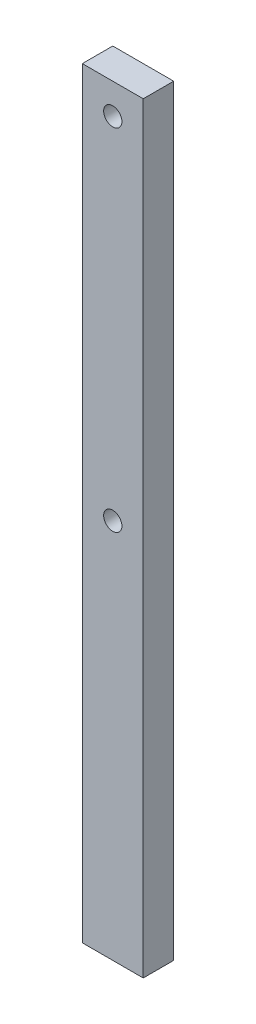
ISO-10303-21;
HEADER;
FILE_DESCRIPTION(('STEP AP214'),'2;1');
FILE_NAME('part.step','',(''),(''),'','','');
FILE_SCHEMA(('AUTOMOTIVE_DESIGN { 1 0 10303 214 1 1 1 1 }'));
ENDSEC;
DATA;
#1=APPLICATION_CONTEXT('core data for automotive mechanical design processes');
#2=APPLICATION_PROTOCOL_DEFINITION('international standard','automotive_design',2000,#1);
#3=PRODUCT_CONTEXT('',#1,'mechanical');
#4=PRODUCT('Part','Part','',(#3));
#5=PRODUCT_RELATED_PRODUCT_CATEGORY('part','',(#4));
#6=PRODUCT_DEFINITION_FORMATION('','',#4);
#7=PRODUCT_DEFINITION_CONTEXT('part definition',#1,'design');
#8=PRODUCT_DEFINITION('design','',#6,#7);
#9=PRODUCT_DEFINITION_SHAPE('','',#8);
#10=(LENGTH_UNIT() NAMED_UNIT(*) SI_UNIT(.MILLI.,.METRE.));
#11=(NAMED_UNIT(*) PLANE_ANGLE_UNIT() SI_UNIT($,.RADIAN.));
#12=(NAMED_UNIT(*) SI_UNIT($,.STERADIAN.) SOLID_ANGLE_UNIT());
#13=UNCERTAINTY_MEASURE_WITH_UNIT(LENGTH_MEASURE(1.E-05),#10,'distance_accuracy_value','');
#14=(GEOMETRIC_REPRESENTATION_CONTEXT(3) GLOBAL_UNCERTAINTY_ASSIGNED_CONTEXT((#13)) GLOBAL_UNIT_ASSIGNED_CONTEXT((#10,
#11,#12)) REPRESENTATION_CONTEXT('',''));
#15=CARTESIAN_POINT('',(0.,0.,0.));
#16=DIRECTION('',(0.,0.,1.));
#17=DIRECTION('',(1.,0.,0.));
#18=AXIS2_PLACEMENT_3D('',#15,#16,#17);
#19=CARTESIAN_POINT('',(10.,-125.,10.));
#20=DIRECTION('',(-1.,0.,0.));
#21=DIRECTION('',(0.,0.,1.));
#22=AXIS2_PLACEMENT_3D('',#19,#20,#21);
#23=PLANE('',#22);
#24=DIRECTION('',(0.,1.,0.));
#25=VECTOR('',#24,1.);
#26=CARTESIAN_POINT('',(10.,-125.,0.));
#27=LINE('',#26,#25);
#28=CARTESIAN_POINT('',(10.,-125.,0.));
#29=VERTEX_POINT('',#28);
#30=CARTESIAN_POINT('',(10.,125.,0.));
#31=VERTEX_POINT('',#30);
#32=EDGE_CURVE('E96',#29,#31,#27,.T.);
#33=ORIENTED_EDGE('',*,*,#32,.T.);
#34=DIRECTION('',(0.,0.,-1.));
#35=VECTOR('',#34,1.);
#36=CARTESIAN_POINT('',(10.,125.,10.));
#37=LINE('',#36,#35);
#38=CARTESIAN_POINT('',(10.,125.,10.));
#39=VERTEX_POINT('',#38);
#40=EDGE_CURVE('E11',#39,#31,#37,.T.);
#41=ORIENTED_EDGE('',*,*,#40,.F.);
#42=DIRECTION('',(0.,1.,0.));
#43=VECTOR('',#42,1.);
#44=CARTESIAN_POINT('',(10.,-125.,10.));
#45=LINE('',#44,#43);
#46=CARTESIAN_POINT('',(10.,-125.,10.));
#47=VERTEX_POINT('',#46);
#48=EDGE_CURVE('E84',#47,#39,#45,.T.);
#49=ORIENTED_EDGE('',*,*,#48,.F.);
#50=DIRECTION('',(0.,0.,-1.));
#51=VECTOR('',#50,1.);
#52=CARTESIAN_POINT('',(10.,-125.,10.));
#53=LINE('',#52,#51);
#54=EDGE_CURVE('E92',#47,#29,#53,.T.);
#55=ORIENTED_EDGE('',*,*,#54,.T.);
#56=EDGE_LOOP('',(#33,#41,#49,#55));
#57=FACE_BOUND('',#56,.T.);
#58=ADVANCED_FACE('F33',(#57),#23,.F.);
#59=CARTESIAN_POINT('',(-10.,125.,10.));
#60=DIRECTION('',(0.,-1.,0.));
#61=DIRECTION('',(0.,0.,-1.));
#62=AXIS2_PLACEMENT_3D('',#59,#60,#61);
#63=PLANE('',#62);
#64=DIRECTION('',(-1.,0.,0.));
#65=VECTOR('',#64,1.);
#66=CARTESIAN_POINT('',(-10.,125.,0.));
#67=LINE('',#66,#65);
#68=CARTESIAN_POINT('',(-10.,125.,0.));
#69=VERTEX_POINT('',#68);
#70=EDGE_CURVE('E88',#31,#69,#67,.T.);
#71=ORIENTED_EDGE('',*,*,#70,.T.);
#72=DIRECTION('',(0.,0.,-1.));
#73=VECTOR('',#72,1.);
#74=CARTESIAN_POINT('',(-10.,125.,10.));
#75=LINE('',#74,#73);
#76=CARTESIAN_POINT('',(-10.,125.,10.));
#77=VERTEX_POINT('',#76);
#78=EDGE_CURVE('E41',#77,#69,#75,.T.);
#79=ORIENTED_EDGE('',*,*,#78,.F.);
#80=DIRECTION('',(-1.,0.,0.));
#81=VECTOR('',#80,1.);
#82=CARTESIAN_POINT('',(-10.,125.,10.));
#83=LINE('',#82,#81);
#84=EDGE_CURVE('E79',#39,#77,#83,.T.);
#85=ORIENTED_EDGE('',*,*,#84,.F.);
#86=ORIENTED_EDGE('',*,*,#40,.T.);
#87=EDGE_LOOP('',(#71,#79,#85,#86));
#88=FACE_BOUND('',#87,.T.);
#89=ADVANCED_FACE('F87',(#88),#63,.F.);
#90=CARTESIAN_POINT('',(-10.,-125.,10.));
#91=DIRECTION('',(1.,0.,0.));
#92=DIRECTION('',(0.,0.,-1.));
#93=AXIS2_PLACEMENT_3D('',#90,#91,#92);
#94=PLANE('',#93);
#95=DIRECTION('',(0.,-1.,0.));
#96=VECTOR('',#95,1.);
#97=CARTESIAN_POINT('',(-10.,-125.,0.));
#98=LINE('',#97,#96);
#99=CARTESIAN_POINT('',(-10.,-125.,0.));
#100=VERTEX_POINT('',#99);
#101=EDGE_CURVE('E66',#69,#100,#98,.T.);
#102=ORIENTED_EDGE('',*,*,#101,.T.);
#103=DIRECTION('',(0.,0.,-1.));
#104=VECTOR('',#103,1.);
#105=CARTESIAN_POINT('',(-10.,-125.,10.));
#106=LINE('',#105,#104);
#107=CARTESIAN_POINT('',(-10.,-125.,10.));
#108=VERTEX_POINT('',#107);
#109=EDGE_CURVE('E89',#108,#100,#106,.T.);
#110=ORIENTED_EDGE('',*,*,#109,.F.);
#111=DIRECTION('',(0.,-1.,0.));
#112=VECTOR('',#111,1.);
#113=CARTESIAN_POINT('',(-10.,-125.,10.));
#114=LINE('',#113,#112);
#115=EDGE_CURVE('E82',#77,#108,#114,.T.);
#116=ORIENTED_EDGE('',*,*,#115,.F.);
#117=ORIENTED_EDGE('',*,*,#78,.T.);
#118=EDGE_LOOP('',(#102,#110,#116,#117));
#119=FACE_BOUND('',#118,.T.);
#120=ADVANCED_FACE('F90',(#119),#94,.F.);
#121=CARTESIAN_POINT('',(-10.,-125.,10.));
#122=DIRECTION('',(0.,1.,0.));
#123=DIRECTION('',(0.,0.,1.));
#124=AXIS2_PLACEMENT_3D('',#121,#122,#123);
#125=PLANE('',#124);
#126=DIRECTION('',(1.,0.,0.));
#127=VECTOR('',#126,1.);
#128=CARTESIAN_POINT('',(-10.,-125.,0.));
#129=LINE('',#128,#127);
#130=EDGE_CURVE('E72',#100,#29,#129,.T.);
#131=ORIENTED_EDGE('',*,*,#130,.T.);
#132=ORIENTED_EDGE('',*,*,#54,.F.);
#133=DIRECTION('',(1.,0.,0.));
#134=VECTOR('',#133,1.);
#135=CARTESIAN_POINT('',(-10.,-125.,10.));
#136=LINE('',#135,#134);
#137=EDGE_CURVE('E49',#108,#47,#136,.T.);
#138=ORIENTED_EDGE('',*,*,#137,.F.);
#139=ORIENTED_EDGE('',*,*,#109,.T.);
#140=EDGE_LOOP('',(#131,#132,#138,#139));
#141=FACE_BOUND('',#140,.T.);
#142=ADVANCED_FACE('F104',(#141),#125,.F.);
#143=CARTESIAN_POINT('',(0.,0.,10.));
#144=DIRECTION('',(0.,0.,-1.));
#145=DIRECTION('',(-1.,0.,0.));
#146=AXIS2_PLACEMENT_3D('',#143,#144,#145);
#147=PLANE('',#146);
#148=CARTESIAN_POINT('',(1.04744440165294E-12,0.,10.));
#149=DIRECTION('',(0.,0.,1.));
#150=DIRECTION('',(1.,0.,0.));
#151=AXIS2_PLACEMENT_3D('',#148,#149,#150);
#152=CIRCLE('',#151,3.);
#153=CARTESIAN_POINT('',(3.00000000000105,0.,10.));
#154=VERTEX_POINT('',#153);
#155=EDGE_CURVE('E118',#154,#154,#152,.T.);
#156=ORIENTED_EDGE('',*,*,#155,.F.);
#157=EDGE_LOOP('',(#156));
#158=FACE_BOUND('',#157,.T.);
#159=CARTESIAN_POINT('',(0.,115.,10.));
#160=DIRECTION('',(0.,0.,1.));
#161=DIRECTION('',(1.,0.,0.));
#162=AXIS2_PLACEMENT_3D('',#159,#160,#161);
#163=CIRCLE('',#162,3.);
#164=CARTESIAN_POINT('',(3.,115.,10.));
#165=VERTEX_POINT('',#164);
#166=EDGE_CURVE('E112',#165,#165,#163,.T.);
#167=ORIENTED_EDGE('',*,*,#166,.F.);
#168=EDGE_LOOP('',(#167));
#169=FACE_BOUND('',#168,.T.);
#170=ORIENTED_EDGE('',*,*,#48,.T.);
#171=ORIENTED_EDGE('',*,*,#84,.T.);
#172=ORIENTED_EDGE('',*,*,#115,.T.);
#173=ORIENTED_EDGE('',*,*,#137,.T.);
#174=EDGE_LOOP('',(#170,#171,#172,#173));
#175=FACE_BOUND('',#174,.T.);
#176=ADVANCED_FACE('F80',(#158,#169,#175),#147,.F.);
#177=CARTESIAN_POINT('',(0.,0.,0.));
#178=DIRECTION('',(0.,0.,-1.));
#179=DIRECTION('',(-1.,0.,0.));
#180=AXIS2_PLACEMENT_3D('',#177,#178,#179);
#181=PLANE('',#180);
#182=CARTESIAN_POINT('',(1.04744440165294E-12,0.,0.));
#183=DIRECTION('',(0.,0.,-1.));
#184=DIRECTION('',(-1.,0.,0.));
#185=AXIS2_PLACEMENT_3D('',#182,#183,#184);
#186=CIRCLE('',#185,3.);
#187=CARTESIAN_POINT('',(-2.99999999999896,0.,0.));
#188=VERTEX_POINT('',#187);
#189=EDGE_CURVE('E115',#188,#188,#186,.F.);
#190=ORIENTED_EDGE('',*,*,#189,.T.);
#191=EDGE_LOOP('',(#190));
#192=FACE_BOUND('',#191,.T.);
#193=CARTESIAN_POINT('',(0.,115.,0.));
#194=DIRECTION('',(0.,0.,-1.));
#195=DIRECTION('',(-1.,0.,0.));
#196=AXIS2_PLACEMENT_3D('',#193,#194,#195);
#197=CIRCLE('',#196,3.);
#198=CARTESIAN_POINT('',(-3.,115.,0.));
#199=VERTEX_POINT('',#198);
#200=EDGE_CURVE('E99',#199,#199,#197,.F.);
#201=ORIENTED_EDGE('',*,*,#200,.T.);
#202=EDGE_LOOP('',(#201));
#203=FACE_BOUND('',#202,.T.);
#204=ORIENTED_EDGE('',*,*,#32,.F.);
#205=ORIENTED_EDGE('',*,*,#130,.F.);
#206=ORIENTED_EDGE('',*,*,#101,.F.);
#207=ORIENTED_EDGE('',*,*,#70,.F.);
#208=EDGE_LOOP('',(#204,#205,#206,#207));
#209=FACE_BOUND('',#208,.T.);
#210=ADVANCED_FACE('F107',(#192,#203,#209),#181,.T.);
#211=CARTESIAN_POINT('',(0.,115.,-8.48528137423858));
#212=DIRECTION('',(0.,0.,1.));
#213=DIRECTION('',(1.,0.,0.));
#214=AXIS2_PLACEMENT_3D('',#211,#212,#213);
#215=CYLINDRICAL_SURFACE('',#214,3.);
#216=ORIENTED_EDGE('',*,*,#166,.T.);
#217=EDGE_LOOP('',(#216));
#218=FACE_BOUND('',#217,.T.);
#219=ORIENTED_EDGE('',*,*,#200,.F.);
#220=EDGE_LOOP('',(#219));
#221=FACE_BOUND('',#220,.T.);
#222=ADVANCED_FACE('F130',(#218,#221),#215,.F.);
#223=CARTESIAN_POINT('',(1.04744440165294E-12,0.,-8.48528137423858));
#224=DIRECTION('',(0.,0.,1.));
#225=DIRECTION('',(1.,0.,0.));
#226=AXIS2_PLACEMENT_3D('',#223,#224,#225);
#227=CYLINDRICAL_SURFACE('',#226,3.);
#228=ORIENTED_EDGE('',*,*,#155,.T.);
#229=EDGE_LOOP('',(#228));
#230=FACE_BOUND('',#229,.T.);
#231=ORIENTED_EDGE('',*,*,#189,.F.);
#232=EDGE_LOOP('',(#231));
#233=FACE_BOUND('',#232,.T.);
#234=ADVANCED_FACE('F122',(#230,#233),#227,.F.);
#235=CLOSED_SHELL('',(#58,#89,#120,#142,#176,#210,#222,#234));
#236=MANIFOLD_SOLID_BREP('B2',#235);
#237=ADVANCED_BREP_SHAPE_REPRESENTATION('',(#18,#236),#14);
#238=SHAPE_DEFINITION_REPRESENTATION(#9,#237);
ENDSEC;
END-ISO-10303-21;
